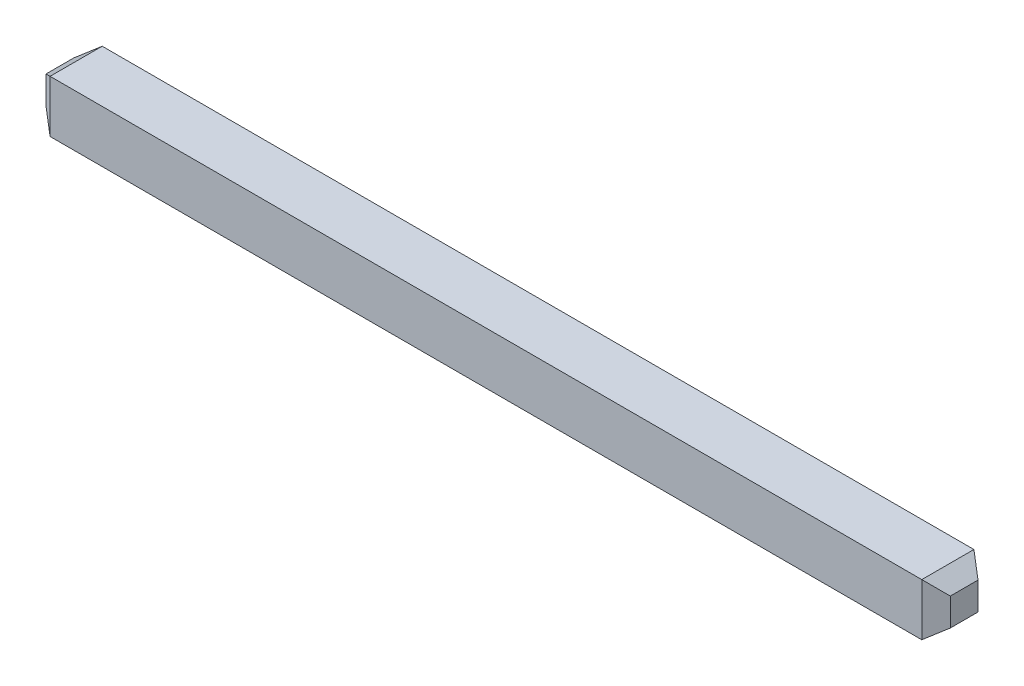
ISO-10303-21;
HEADER;
FILE_DESCRIPTION(('STEP AP214'),'2;1');
FILE_NAME('part.step','',(''),(''),'','','');
FILE_SCHEMA(('AUTOMOTIVE_DESIGN { 1 0 10303 214 1 1 1 1 }'));
ENDSEC;
DATA;
#1=APPLICATION_CONTEXT('core data for automotive mechanical design processes');
#2=APPLICATION_PROTOCOL_DEFINITION('international standard','automotive_design',2000,#1);
#3=PRODUCT_CONTEXT('',#1,'mechanical');
#4=PRODUCT('Part','Part','',(#3));
#5=PRODUCT_RELATED_PRODUCT_CATEGORY('part','',(#4));
#6=PRODUCT_DEFINITION_FORMATION('','',#4);
#7=PRODUCT_DEFINITION_CONTEXT('part definition',#1,'design');
#8=PRODUCT_DEFINITION('design','',#6,#7);
#9=PRODUCT_DEFINITION_SHAPE('','',#8);
#10=(LENGTH_UNIT() NAMED_UNIT(*) SI_UNIT(.MILLI.,.METRE.));
#11=(NAMED_UNIT(*) PLANE_ANGLE_UNIT() SI_UNIT($,.RADIAN.));
#12=(NAMED_UNIT(*) SI_UNIT($,.STERADIAN.) SOLID_ANGLE_UNIT());
#13=UNCERTAINTY_MEASURE_WITH_UNIT(LENGTH_MEASURE(1.E-05),#10,'distance_accuracy_value','');
#14=(GEOMETRIC_REPRESENTATION_CONTEXT(3) GLOBAL_UNCERTAINTY_ASSIGNED_CONTEXT((#13)) GLOBAL_UNIT_ASSIGNED_CONTEXT((#10,
#11,#12)) REPRESENTATION_CONTEXT('',''));
#15=CARTESIAN_POINT('',(0.,0.,0.));
#16=DIRECTION('',(0.,0.,1.));
#17=DIRECTION('',(1.,0.,0.));
#18=AXIS2_PLACEMENT_3D('',#15,#16,#17);
#19=CARTESIAN_POINT('',(-2.4,1.23,-42.155));
#20=DIRECTION('',(0.599999999990736,0.,0.800000000006948));
#21=DIRECTION('',(0.800000000006948,0.,-0.599999999990736));
#22=AXIS2_PLACEMENT_3D('',#19,#20,#21);
#23=PLANE('',#22);
#24=DIRECTION('',(0.,1.,0.));
#25=VECTOR('',#24,1.);
#26=CARTESIAN_POINT('',(-2.3,1.23,-42.23));
#27=LINE('',#26,#25);
#28=CARTESIAN_POINT('',(-2.29999999999957,1.55,-42.2299999999994));
#29=VERTEX_POINT('',#28);
#30=CARTESIAN_POINT('',(-2.29999999999958,0.909999999999898,-42.2299999999994));
#31=VERTEX_POINT('',#30);
#32=EDGE_CURVE('E101',#29,#31,#27,.F.);
#33=ORIENTED_EDGE('',*,*,#32,.T.);
#34=DIRECTION('',(-0.685994340569495,0.514495755428344,0.514495755427429));
#35=VECTOR('',#34,1.);
#36=CARTESIAN_POINT('',(-2.30000000000009,0.909999999999786,-42.23));
#37=LINE('',#36,#35);
#38=CARTESIAN_POINT('',(-2.50000000000021,1.06000000000001,-42.0800000000003));
#39=VERTEX_POINT('',#38);
#40=EDGE_CURVE('E85',#31,#39,#37,.T.);
#41=ORIENTED_EDGE('',*,*,#40,.T.);
#42=DIRECTION('',(0.,1.,0.));
#43=VECTOR('',#42,1.);
#44=CARTESIAN_POINT('',(-2.5,1.23,-42.08));
#45=LINE('',#44,#43);
#46=CARTESIAN_POINT('',(-2.50000000000044,1.4,-42.0800000000006));
#47=VERTEX_POINT('',#46);
#48=EDGE_CURVE('E79',#39,#47,#45,.T.);
#49=ORIENTED_EDGE('',*,*,#48,.T.);
#50=DIRECTION('',(-0.685994340570038,-0.514495755427529,0.51449575542752));
#51=VECTOR('',#50,1.);
#52=CARTESIAN_POINT('',(-2.3,1.55,-42.23));
#53=LINE('',#52,#51);
#54=EDGE_CURVE('E20',#29,#47,#53,.T.);
#55=ORIENTED_EDGE('',*,*,#54,.F.);
#56=EDGE_LOOP('',(#33,#41,#49,#55));
#57=FACE_BOUND('',#56,.T.);
#58=ADVANCED_FACE('F17',(#57),#23,.F.);
#59=CARTESIAN_POINT('',(8.5,1.23,-42.155));
#60=DIRECTION('',(-0.599999999990736,0.,0.800000000006948));
#61=DIRECTION('',(0.800000000006948,0.,0.599999999990736));
#62=AXIS2_PLACEMENT_3D('',#59,#60,#61);
#63=PLANE('',#62);
#64=DIRECTION('',(0.,1.,0.));
#65=VECTOR('',#64,1.);
#66=CARTESIAN_POINT('',(8.6,1.23,-42.08));
#67=LINE('',#66,#65);
#68=CARTESIAN_POINT('',(8.6000000000002,1.06000000000003,-42.0800000000003));
#69=VERTEX_POINT('',#68);
#70=CARTESIAN_POINT('',(8.60000000000044,1.4,-42.0800000000006));
#71=VERTEX_POINT('',#70);
#72=EDGE_CURVE('E113',#69,#71,#67,.T.);
#73=ORIENTED_EDGE('',*,*,#72,.F.);
#74=DIRECTION('',(-0.685994340569496,-0.514495755428343,-0.514495755427429));
#75=VECTOR('',#74,1.);
#76=CARTESIAN_POINT('',(8.59999999999996,1.06000000000005,-42.08));
#77=LINE('',#76,#75);
#78=CARTESIAN_POINT('',(8.39999999999959,0.909999999999884,-42.2299999999994));
#79=VERTEX_POINT('',#78);
#80=EDGE_CURVE('E108',#69,#79,#77,.T.);
#81=ORIENTED_EDGE('',*,*,#80,.T.);
#82=DIRECTION('',(0.,1.,0.));
#83=VECTOR('',#82,1.);
#84=CARTESIAN_POINT('',(8.4,1.23,-42.23));
#85=LINE('',#84,#83);
#86=CARTESIAN_POINT('',(8.39999999999957,1.55,-42.2299999999994));
#87=VERTEX_POINT('',#86);
#88=EDGE_CURVE('E99',#79,#87,#85,.T.);
#89=ORIENTED_EDGE('',*,*,#88,.T.);
#90=DIRECTION('',(-0.685994340570037,0.514495755427528,-0.514495755427522));
#91=VECTOR('',#90,1.);
#92=CARTESIAN_POINT('',(8.6,1.4,-42.08));
#93=LINE('',#92,#91);
#94=EDGE_CURVE('E116',#71,#87,#93,.T.);
#95=ORIENTED_EDGE('',*,*,#94,.F.);
#96=EDGE_LOOP('',(#73,#81,#89,#95));
#97=FACE_BOUND('',#96,.T.);
#98=ADVANCED_FACE('F214',(#97),#63,.F.);
#99=CARTESIAN_POINT('',(-2.4,1.475,-41.91));
#100=DIRECTION('',(-0.6,0.8,0.));
#101=DIRECTION('',(-0.8,-0.6,0.));
#102=AXIS2_PLACEMENT_3D('',#99,#100,#101);
#103=PLANE('',#102);
#104=DIRECTION('',(-0.685994340575994,-0.514495755427521,-0.514495755419586));
#105=VECTOR('',#104,1.);
#106=CARTESIAN_POINT('',(-2.29999999999913,1.55,-41.5900000000012));
#107=LINE('',#106,#105);
#108=CARTESIAN_POINT('',(-2.29999999999989,1.55,-41.5900000000001));
#109=VERTEX_POINT('',#108);
#110=CARTESIAN_POINT('',(-2.50000000000022,1.4,-41.7399999999997));
#111=VERTEX_POINT('',#110);
#112=EDGE_CURVE('E128',#109,#111,#107,.T.);
#113=ORIENTED_EDGE('',*,*,#112,.F.);
#114=DIRECTION('',(0.,0.,1.));
#115=VECTOR('',#114,1.);
#116=CARTESIAN_POINT('',(-2.3,1.55,-41.91));
#117=LINE('',#116,#115);
#118=EDGE_CURVE('E93',#29,#109,#117,.T.);
#119=ORIENTED_EDGE('',*,*,#118,.F.);
#120=ORIENTED_EDGE('',*,*,#54,.T.);
#121=DIRECTION('',(0.,0.,-1.));
#122=VECTOR('',#121,1.);
#123=CARTESIAN_POINT('',(-2.5,1.4,-41.91));
#124=LINE('',#123,#122);
#125=EDGE_CURVE('E87',#47,#111,#124,.F.);
#126=ORIENTED_EDGE('',*,*,#125,.T.);
#127=EDGE_LOOP('',(#113,#119,#120,#126));
#128=FACE_BOUND('',#127,.T.);
#129=ADVANCED_FACE('F90',(#128),#103,.T.);
#130=CARTESIAN_POINT('',(-2.5,1.23,-41.91));
#131=DIRECTION('',(1.,0.,0.));
#132=DIRECTION('',(0.,0.,-1.));
#133=AXIS2_PLACEMENT_3D('',#130,#131,#132);
#134=PLANE('',#133);
#135=DIRECTION('',(0.,1.,0.));
#136=VECTOR('',#135,1.);
#137=CARTESIAN_POINT('',(-2.50000000000087,1.23,-41.7399999999989));
#138=LINE('',#137,#136);
#139=CARTESIAN_POINT('',(-2.50000000000021,1.06000000000001,-41.7399999999997));
#140=VERTEX_POINT('',#139);
#141=EDGE_CURVE('E97',#111,#140,#138,.F.);
#142=ORIENTED_EDGE('',*,*,#141,.F.);
#143=ORIENTED_EDGE('',*,*,#125,.F.);
#144=ORIENTED_EDGE('',*,*,#48,.F.);
#145=DIRECTION('',(0.,0.,1.));
#146=VECTOR('',#145,1.);
#147=CARTESIAN_POINT('',(-2.49999999999996,1.06000000000005,-41.91));
#148=LINE('',#147,#146);
#149=EDGE_CURVE('E105',#39,#140,#148,.T.);
#150=ORIENTED_EDGE('',*,*,#149,.T.);
#151=EDGE_LOOP('',(#142,#143,#144,#150));
#152=FACE_BOUND('',#151,.T.);
#153=ADVANCED_FACE('F95',(#152),#134,.F.);
#154=CARTESIAN_POINT('',(3.05,1.23,-42.23));
#155=DIRECTION('',(0.,0.,1.));
#156=DIRECTION('',(1.,0.,0.));
#157=AXIS2_PLACEMENT_3D('',#154,#155,#156);
#158=PLANE('',#157);
#159=ORIENTED_EDGE('',*,*,#32,.F.);
#160=DIRECTION('',(1.,0.,0.));
#161=VECTOR('',#160,1.);
#162=CARTESIAN_POINT('',(3.05,1.55,-42.23));
#163=LINE('',#162,#161);
#164=EDGE_CURVE('E122',#87,#29,#163,.F.);
#165=ORIENTED_EDGE('',*,*,#164,.F.);
#166=ORIENTED_EDGE('',*,*,#88,.F.);
#167=DIRECTION('',(1.,0.,0.));
#168=VECTOR('',#167,1.);
#169=CARTESIAN_POINT('',(3.05,0.91,-42.23));
#170=LINE('',#169,#168);
#171=EDGE_CURVE('E136',#79,#31,#170,.F.);
#172=ORIENTED_EDGE('',*,*,#171,.T.);
#173=EDGE_LOOP('',(#159,#165,#166,#172));
#174=FACE_BOUND('',#173,.T.);
#175=ADVANCED_FACE('F182',(#174),#158,.F.);
#176=CARTESIAN_POINT('',(-2.4,0.9849999999999,-41.91));
#177=DIRECTION('',(0.600000000000912,0.799999999999316,0.));
#178=DIRECTION('',(-0.799999999999316,0.600000000000912,0.));
#179=AXIS2_PLACEMENT_3D('',#176,#177,#178);
#180=PLANE('',#179);
#181=DIRECTION('',(0.,0.,1.));
#182=VECTOR('',#181,1.);
#183=CARTESIAN_POINT('',(-2.3,0.91,-41.91));
#184=LINE('',#183,#182);
#185=CARTESIAN_POINT('',(-2.29999999999983,0.909999999999856,-41.5900000000003));
#186=VERTEX_POINT('',#185);
#187=EDGE_CURVE('E139',#31,#186,#184,.T.);
#188=ORIENTED_EDGE('',*,*,#187,.T.);
#189=DIRECTION('',(0.685994340575873,-0.514495755427774,0.514495755419495));
#190=VECTOR('',#189,1.);
#191=CARTESIAN_POINT('',(-2.50000000000087,1.06,-41.7399999999989));
#192=LINE('',#191,#190);
#193=EDGE_CURVE('E131',#140,#186,#192,.T.);
#194=ORIENTED_EDGE('',*,*,#193,.F.);
#195=ORIENTED_EDGE('',*,*,#149,.F.);
#196=ORIENTED_EDGE('',*,*,#40,.F.);
#197=EDGE_LOOP('',(#188,#194,#195,#196));
#198=FACE_BOUND('',#197,.T.);
#199=ADVANCED_FACE('F179',(#198),#180,.F.);
#200=CARTESIAN_POINT('',(8.5,0.9849999999999,-41.91));
#201=DIRECTION('',(-0.600000000000912,0.799999999999316,0.));
#202=DIRECTION('',(-0.799999999999316,-0.600000000000912,0.));
#203=AXIS2_PLACEMENT_3D('',#200,#201,#202);
#204=PLANE('',#203);
#205=DIRECTION('',(0.,0.,-1.));
#206=VECTOR('',#205,1.);
#207=CARTESIAN_POINT('',(8.6,1.06,-41.91));
#208=LINE('',#207,#206);
#209=CARTESIAN_POINT('',(8.6000000000002,1.06000000000003,-41.7399999999997));
#210=VERTEX_POINT('',#209);
#211=EDGE_CURVE('E110',#210,#69,#208,.T.);
#212=ORIENTED_EDGE('',*,*,#211,.F.);
#213=DIRECTION('',(0.685994340575872,0.514495755427775,-0.514495755419496));
#214=VECTOR('',#213,1.);
#215=CARTESIAN_POINT('',(8.39999999999913,0.9099999999999,-41.5900000000012));
#216=LINE('',#215,#214);
#217=CARTESIAN_POINT('',(8.39999999999993,0.909999999999868,-41.5900000000001));
#218=VERTEX_POINT('',#217);
#219=EDGE_CURVE('E35',#218,#210,#216,.T.);
#220=ORIENTED_EDGE('',*,*,#219,.F.);
#221=DIRECTION('',(0.,0.,1.));
#222=VECTOR('',#221,1.);
#223=CARTESIAN_POINT('',(8.4,0.91,-41.91));
#224=LINE('',#223,#222);
#225=EDGE_CURVE('E134',#218,#79,#224,.F.);
#226=ORIENTED_EDGE('',*,*,#225,.T.);
#227=ORIENTED_EDGE('',*,*,#80,.F.);
#228=EDGE_LOOP('',(#212,#220,#226,#227));
#229=FACE_BOUND('',#228,.T.);
#230=ADVANCED_FACE('F181',(#229),#204,.F.);
#231=CARTESIAN_POINT('',(8.6,1.23,-41.91));
#232=DIRECTION('',(1.,0.,0.));
#233=DIRECTION('',(0.,0.,-1.));
#234=AXIS2_PLACEMENT_3D('',#231,#232,#233);
#235=PLANE('',#234);
#236=ORIENTED_EDGE('',*,*,#72,.T.);
#237=DIRECTION('',(0.,0.,1.));
#238=VECTOR('',#237,1.);
#239=CARTESIAN_POINT('',(8.6,1.4,-41.91));
#240=LINE('',#239,#238);
#241=CARTESIAN_POINT('',(8.60000000000022,1.4,-41.7399999999997));
#242=VERTEX_POINT('',#241);
#243=EDGE_CURVE('E119',#242,#71,#240,.F.);
#244=ORIENTED_EDGE('',*,*,#243,.F.);
#245=DIRECTION('',(0.,1.,0.));
#246=VECTOR('',#245,1.);
#247=CARTESIAN_POINT('',(8.60000000000087,1.23,-41.7399999999989));
#248=LINE('',#247,#246);
#249=EDGE_CURVE('E142',#210,#242,#248,.T.);
#250=ORIENTED_EDGE('',*,*,#249,.F.);
#251=ORIENTED_EDGE('',*,*,#211,.T.);
#252=EDGE_LOOP('',(#236,#244,#250,#251));
#253=FACE_BOUND('',#252,.T.);
#254=ADVANCED_FACE('F189',(#253),#235,.T.);
#255=CARTESIAN_POINT('',(8.5,1.475,-41.91));
#256=DIRECTION('',(0.6,0.8,0.));
#257=DIRECTION('',(-0.8,0.6,0.));
#258=AXIS2_PLACEMENT_3D('',#255,#256,#257);
#259=PLANE('',#258);
#260=DIRECTION('',(-0.685994340575993,0.514495755427522,0.514495755419587));
#261=VECTOR('',#260,1.);
#262=CARTESIAN_POINT('',(8.60000000000087,1.4,-41.7399999999989));
#263=LINE('',#262,#261);
#264=CARTESIAN_POINT('',(8.39999999999989,1.55,-41.5900000000001));
#265=VERTEX_POINT('',#264);
#266=EDGE_CURVE('E145',#242,#265,#263,.T.);
#267=ORIENTED_EDGE('',*,*,#266,.F.);
#268=ORIENTED_EDGE('',*,*,#243,.T.);
#269=ORIENTED_EDGE('',*,*,#94,.T.);
#270=DIRECTION('',(0.,0.,1.));
#271=VECTOR('',#270,1.);
#272=CARTESIAN_POINT('',(8.4,1.55,-41.91));
#273=LINE('',#272,#271);
#274=EDGE_CURVE('E125',#265,#87,#273,.F.);
#275=ORIENTED_EDGE('',*,*,#274,.F.);
#276=EDGE_LOOP('',(#267,#268,#269,#275));
#277=FACE_BOUND('',#276,.T.);
#278=ADVANCED_FACE('F170',(#277),#259,.T.);
#279=CARTESIAN_POINT('',(3.05,1.55,-41.91));
#280=DIRECTION('',(0.,1.,0.));
#281=DIRECTION('',(0.,0.,1.));
#282=AXIS2_PLACEMENT_3D('',#279,#280,#281);
#283=PLANE('',#282);
#284=DIRECTION('',(1.,0.,0.));
#285=VECTOR('',#284,1.);
#286=CARTESIAN_POINT('',(3.05,1.55,-41.59));
#287=LINE('',#286,#285);
#288=EDGE_CURVE('E148',#265,#109,#287,.F.);
#289=ORIENTED_EDGE('',*,*,#288,.F.);
#290=ORIENTED_EDGE('',*,*,#274,.T.);
#291=ORIENTED_EDGE('',*,*,#164,.T.);
#292=ORIENTED_EDGE('',*,*,#118,.T.);
#293=EDGE_LOOP('',(#289,#290,#291,#292));
#294=FACE_BOUND('',#293,.T.);
#295=ADVANCED_FACE('F173',(#294),#283,.T.);
#296=CARTESIAN_POINT('',(-2.4,1.23,-41.665));
#297=DIRECTION('',(-0.599999999990736,0.,0.800000000006948));
#298=DIRECTION('',(0.800000000006948,0.,0.599999999990736));
#299=AXIS2_PLACEMENT_3D('',#296,#297,#298);
#300=PLANE('',#299);
#301=ORIENTED_EDGE('',*,*,#193,.T.);
#302=DIRECTION('',(0.,1.,0.));
#303=VECTOR('',#302,1.);
#304=CARTESIAN_POINT('',(-2.3,1.23,-41.59));
#305=LINE('',#304,#303);
#306=EDGE_CURVE('E151',#109,#186,#305,.F.);
#307=ORIENTED_EDGE('',*,*,#306,.F.);
#308=ORIENTED_EDGE('',*,*,#112,.T.);
#309=ORIENTED_EDGE('',*,*,#141,.T.);
#310=EDGE_LOOP('',(#301,#307,#308,#309));
#311=FACE_BOUND('',#310,.T.);
#312=ADVANCED_FACE('F176',(#311),#300,.T.);
#313=CARTESIAN_POINT('',(3.05,0.91,-41.91));
#314=DIRECTION('',(0.,1.,0.));
#315=DIRECTION('',(0.,0.,1.));
#316=AXIS2_PLACEMENT_3D('',#313,#314,#315);
#317=PLANE('',#316);
#318=ORIENTED_EDGE('',*,*,#187,.F.);
#319=ORIENTED_EDGE('',*,*,#171,.F.);
#320=ORIENTED_EDGE('',*,*,#225,.F.);
#321=DIRECTION('',(1.,0.,0.));
#322=VECTOR('',#321,1.);
#323=CARTESIAN_POINT('',(3.05,0.9099999999999,-41.59));
#324=LINE('',#323,#322);
#325=EDGE_CURVE('E26',#186,#218,#324,.T.);
#326=ORIENTED_EDGE('',*,*,#325,.F.);
#327=EDGE_LOOP('',(#318,#319,#320,#326));
#328=FACE_BOUND('',#327,.T.);
#329=ADVANCED_FACE('F162',(#328),#317,.F.);
#330=CARTESIAN_POINT('',(8.5,1.23,-41.665));
#331=DIRECTION('',(0.599999999990736,0.,0.800000000006948));
#332=DIRECTION('',(0.800000000006948,0.,-0.599999999990736));
#333=AXIS2_PLACEMENT_3D('',#330,#331,#332);
#334=PLANE('',#333);
#335=ORIENTED_EDGE('',*,*,#266,.T.);
#336=DIRECTION('',(0.,1.,0.));
#337=VECTOR('',#336,1.);
#338=CARTESIAN_POINT('',(8.4,1.23,-41.59));
#339=LINE('',#338,#337);
#340=EDGE_CURVE('E11',#218,#265,#339,.T.);
#341=ORIENTED_EDGE('',*,*,#340,.F.);
#342=ORIENTED_EDGE('',*,*,#219,.T.);
#343=ORIENTED_EDGE('',*,*,#249,.T.);
#344=EDGE_LOOP('',(#335,#341,#342,#343));
#345=FACE_BOUND('',#344,.T.);
#346=ADVANCED_FACE('F166',(#345),#334,.T.);
#347=CARTESIAN_POINT('',(3.05,1.23,-41.59));
#348=DIRECTION('',(0.,0.,1.));
#349=DIRECTION('',(1.,0.,0.));
#350=AXIS2_PLACEMENT_3D('',#347,#348,#349);
#351=PLANE('',#350);
#352=ORIENTED_EDGE('',*,*,#325,.T.);
#353=ORIENTED_EDGE('',*,*,#340,.T.);
#354=ORIENTED_EDGE('',*,*,#288,.T.);
#355=ORIENTED_EDGE('',*,*,#306,.T.);
#356=EDGE_LOOP('',(#352,#353,#354,#355));
#357=FACE_BOUND('',#356,.T.);
#358=ADVANCED_FACE('F157',(#357),#351,.T.);
#359=CLOSED_SHELL('',(#58,#98,#129,#153,#175,#199,#230,#254,#278,#295,#312,#329,#346,#358));
#360=MANIFOLD_SOLID_BREP('B1',#359);
#361=ADVANCED_BREP_SHAPE_REPRESENTATION('',(#18,#360),#14);
#362=SHAPE_DEFINITION_REPRESENTATION(#9,#361);
ENDSEC;
END-ISO-10303-21;
